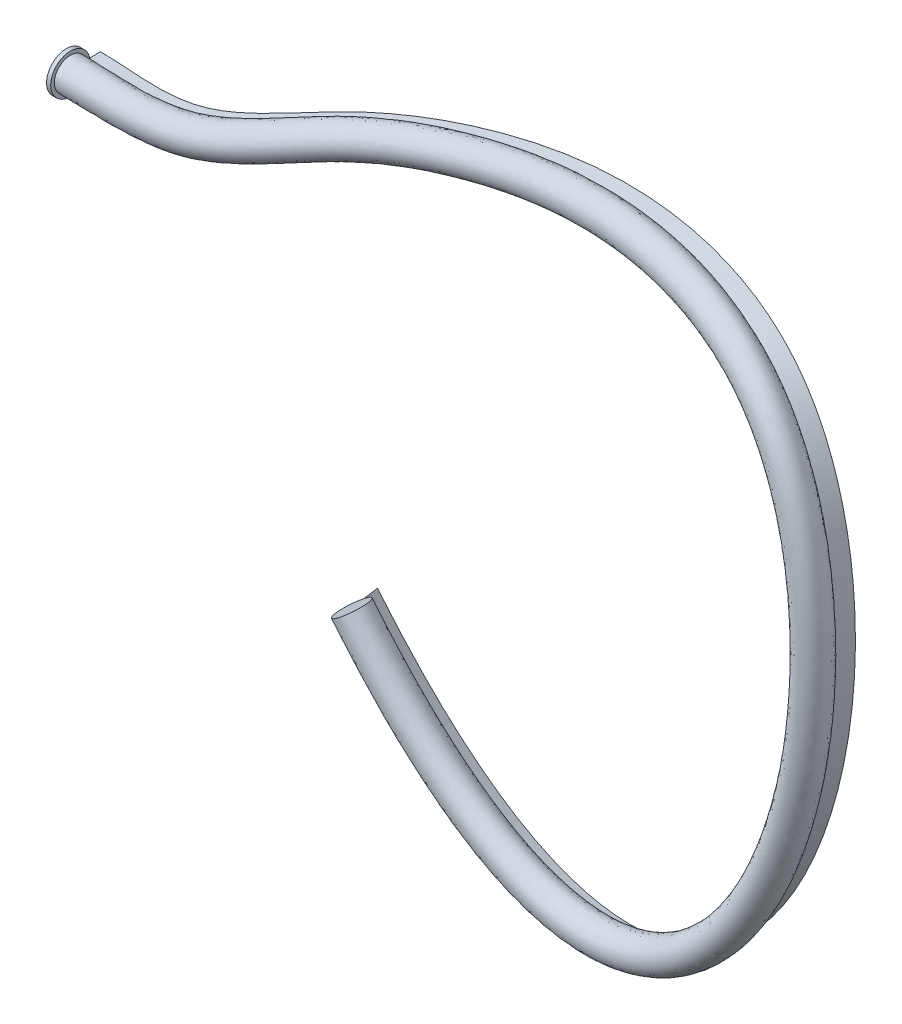
ISO-10303-21;
HEADER;
FILE_DESCRIPTION(('STEP AP214'),'2;1');
FILE_NAME('part.step','',(''),(''),'','','');
FILE_SCHEMA(('AUTOMOTIVE_DESIGN { 1 0 10303 214 1 1 1 1 }'));
ENDSEC;
DATA;
#1=APPLICATION_CONTEXT('core data for automotive mechanical design processes');
#2=APPLICATION_PROTOCOL_DEFINITION('international standard','automotive_design',2000,#1);
#3=PRODUCT_CONTEXT('',#1,'mechanical');
#4=PRODUCT('Part','Part','',(#3));
#5=PRODUCT_RELATED_PRODUCT_CATEGORY('part','',(#4));
#6=PRODUCT_DEFINITION_FORMATION('','',#4);
#7=PRODUCT_DEFINITION_CONTEXT('part definition',#1,'design');
#8=PRODUCT_DEFINITION('design','',#6,#7);
#9=PRODUCT_DEFINITION_SHAPE('','',#8);
#10=(LENGTH_UNIT() NAMED_UNIT(*) SI_UNIT(.MILLI.,.METRE.));
#11=(NAMED_UNIT(*) PLANE_ANGLE_UNIT() SI_UNIT($,.RADIAN.));
#12=(NAMED_UNIT(*) SI_UNIT($,.STERADIAN.) SOLID_ANGLE_UNIT());
#13=UNCERTAINTY_MEASURE_WITH_UNIT(LENGTH_MEASURE(1.E-05),#10,'distance_accuracy_value','');
#14=(GEOMETRIC_REPRESENTATION_CONTEXT(3) GLOBAL_UNCERTAINTY_ASSIGNED_CONTEXT((#13)) GLOBAL_UNIT_ASSIGNED_CONTEXT((#10,
#11,#12)) REPRESENTATION_CONTEXT('',''));
#15=CARTESIAN_POINT('',(0.,0.,0.));
#16=DIRECTION('',(0.,0.,1.));
#17=DIRECTION('',(1.,0.,0.));
#18=AXIS2_PLACEMENT_3D('',#15,#16,#17);
#19=CARTESIAN_POINT('',(0.,0.,0.));
#20=CARTESIAN_POINT('',(27.4642254197637,0.,0.));
#21=CARTESIAN_POINT('',(87.8028374452082,-8.95382087645974,-0.763146101907971));
#22=CARTESIAN_POINT('',(141.076947686574,2.97237020859592,-59.7113201060918));
#23=CARTESIAN_POINT('',(219.006101079918,19.7132858915344,-75.5523583560553));
#24=CARTESIAN_POINT('',(291.223654158455,30.9058604483519,-77.5395152107079));
#25=CARTESIAN_POINT('',(344.593372414246,33.3375584774099,-72.224261736461));
#26=CARTESIAN_POINT('',(383.873309377211,29.5075604955502,-66.2356873423279));
#27=CARTESIAN_POINT('',(411.068676163393,23.2112452597902,-61.3112827107355));
#28=CARTESIAN_POINT('',(435.36073516366,12.9604326469236,-56.459620523459));
#29=CARTESIAN_POINT('',(456.563884556257,-2.15390799178407,-52.0949665502684));
#30=CARTESIAN_POINT('',(473.824504640785,-22.9034678459883,-48.7196242824229));
#31=CARTESIAN_POINT('',(487.053762900805,-48.717354384585,-46.2637357664456));
#32=CARTESIAN_POINT('',(496.047324943182,-78.3126146809638,-44.70790712439));
#33=CARTESIAN_POINT('',(500.989726817628,-110.812929678873,-43.9447184981664));
#34=CARTESIAN_POINT('',(502.297493320532,-153.026500929402,-43.8547260839556));
#35=CARTESIAN_POINT('',(496.732252577597,-205.165925265141,-44.8756810767276));
#36=CARTESIAN_POINT('',(480.887884778751,-264.550287447351,-47.1983119661923));
#37=CARTESIAN_POINT('',(456.453812766938,-319.135107881967,-50.184053040146));
#38=CARTESIAN_POINT('',(427.839943869651,-359.812756889257,-52.9995220224812));
#39=CARTESIAN_POINT('',(398.315448890457,-387.079953193103,-55.268741821072));
#40=CARTESIAN_POINT('',(373.304902638258,-401.720707157502,-56.7524294496686));
#41=CARTESIAN_POINT('',(349.746263729788,-409.285806670358,-57.7793674075634));
#42=CARTESIAN_POINT('',(328.478304247406,-411.820298387361,-58.4313215676932));
#43=CARTESIAN_POINT('',(306.207940957278,-410.050720311049,-58.8126658998736));
#44=CARTESIAN_POINT('',(283.010979007269,-403.627673723908,-58.8813700954736));
#45=CARTESIAN_POINT('',(258.95063986662,-392.183859556376,-58.594278895844));
#46=CARTESIAN_POINT('',(234.137111181567,-375.418788365328,-57.9124356982976));
#47=CARTESIAN_POINT('',(208.505299568889,-352.782632553914,-56.7812142263173));
#48=CARTESIAN_POINT('',(182.644269586236,-324.656107513751,-55.2044682427444));
#49=CARTESIAN_POINT('',(164.015913233564,-300.183432395464,-53.7133567654584));
#50=CARTESIAN_POINT('',(155.564644102647,-288.161459197369,-52.9578350171391));
#51=CARTESIAN_POINT('',(0.,0.,-24.9990652689149));
#52=CARTESIAN_POINT('',(23.4397974321019,0.,-24.9990652689149));
#53=CARTESIAN_POINT('',(72.7075948441988,-8.21377026665749,-21.4570515432783));
#54=CARTESIAN_POINT('',(129.123029021942,2.93488426135868,-81.9800254527582));
#55=CARTESIAN_POINT('',(216.081974991389,21.8705259901921,-100.664995291414));
#56=CARTESIAN_POINT('',(291.99919139523,33.4885992306604,-102.394093425112));
#57=CARTESIAN_POINT('',(347.689133693887,36.000896095956,-96.9162811350075));
#58=CARTESIAN_POINT('',(388.375508660656,32.0218239063734,-90.7021882630142));
#59=CARTESIAN_POINT('',(416.452644237187,25.5140093029483,-85.6202240643835));
#60=CARTESIAN_POINT('',(441.423292363229,14.9580361215586,-80.6324669740406));
#61=CARTESIAN_POINT('',(463.012744230634,-0.453375870169354,-76.1892177364903));
#62=CARTESIAN_POINT('',(480.537454774249,-21.5211541109059,-72.7620231529115));
#63=CARTESIAN_POINT('',(493.950157659089,-47.6969986562345,-70.2721006711098));
#64=CARTESIAN_POINT('',(503.047785156256,-77.6411656536702,-68.6982503913893));
#65=CARTESIAN_POINT('',(508.041489873907,-110.480902360948,-67.9270844922746));
#66=CARTESIAN_POINT('',(509.361721054084,-153.106065149904,-67.8362184833908));
#67=CARTESIAN_POINT('',(503.746097662431,-205.750790439483,-68.8662314897073));
#68=CARTESIAN_POINT('',(487.729802068345,-265.810401146765,-71.2140861169023));
#69=CARTESIAN_POINT('',(462.935081086679,-321.238890275976,-74.2442897875836));
#70=CARTESIAN_POINT('',(433.673723597776,-362.897368003788,-77.1250238754868));
#71=CARTESIAN_POINT('',(403.090315987776,-391.178392270715,-79.4771856059041));
#72=CARTESIAN_POINT('',(376.827766744699,-406.58212931887,-81.0364814275652));
#73=CARTESIAN_POINT('',(351.824761912753,-414.620177617652,-82.1268880938059));
#74=CARTESIAN_POINT('',(329.156448486824,-417.323304958942,-82.8217817247826));
#75=CARTESIAN_POINT('',(305.465092782082,-415.435189244051,-83.2269861064821));
#76=CARTESIAN_POINT('',(280.976421399386,-408.642974092636,-83.2986036369433));
#77=CARTESIAN_POINT('',(255.840632598843,-396.674787202412,-82.9976500971865));
#78=CARTESIAN_POINT('',(230.18045054057,-379.324568083113,-82.2914665771336));
#79=CARTESIAN_POINT('',(203.903566473086,-356.110657261693,-81.1310988798192));
#80=CARTESIAN_POINT('',(177.547945048403,-327.434471618828,-79.523197570618));
#81=CARTESIAN_POINT('',(158.686828284841,-302.654762207525,-78.0133382777274));
#82=CARTESIAN_POINT('',(150.117218836602,-290.464449307895,-77.2472372090653));
#83=B_SPLINE_SURFACE_WITH_KNOTS('',1,3,((#19,#20,#21,#22,#23,#24,#25,#26,#27,#28,#29,#30,#31,
#32,#33,#34,#35,#36,#37,#38,#39,#40,#41,#42,#43,#44,#45,#46,#47,#48,#49,#50),(#51,#52,#53,#54,
#55,#56,#57,#58,#59,#60,#61,#62,#63,#64,#65,#66,#67,#68,#69,#70,#71,#72,#73,#74,#75,#76,#77,#78,
#79,#80,#81,#82)),.UNSPECIFIED.,.F.,.F.,.F.,(2,2),(4,1,1,1,1,1,1,1,1,1,1,1,1,1,1,1,1,1,1,1,1,1,
1,1,1,1,1,1,1,4),(0.,1.),(0.,0.0703125,0.140625,0.2109375,0.263671875,0.31640625,0.3427734375,
0.369140625,0.3955078125,0.421875,0.45,0.478125,0.50625,0.534375000000009,0.5625,0.609375,
0.65625,0.703125,0.75,0.78125,0.8125,0.833333333333333,0.854166666666667,0.875000000000003,
0.895833333333333,0.916666666666667,0.9375,0.958333333333333,0.979166666666667,1.),.UNSPECIFIED.);
#84=DIRECTION('',(0.,0.,-1.));
#85=VECTOR('',#84,1.);
#86=CARTESIAN_POINT('',(0.,0.,-12.4995326344575));
#87=LINE('',#86,#85);
#88=CARTESIAN_POINT('',(0.,0.,0.));
#89=VERTEX_POINT('',#88);
#90=CARTESIAN_POINT('',(0.,0.,-24.9990652689149));
#91=VERTEX_POINT('',#90);
#92=EDGE_CURVE('E13',#89,#91,#87,.T.);
#93=CARTESIAN_POINT('',(0.,0.,-24.9990652689149));
#94=CARTESIAN_POINT('',(23.4397974321019,0.,-24.9990652689149));
#95=CARTESIAN_POINT('',(72.7075948441988,-8.21377026665749,-21.4570515432783));
#96=CARTESIAN_POINT('',(129.123029021942,2.93488426135868,-81.9800254527582));
#97=CARTESIAN_POINT('',(216.081974991389,21.8705259901921,-100.664995291414));
#98=CARTESIAN_POINT('',(291.99919139523,33.4885992306604,-102.394093425112));
#99=CARTESIAN_POINT('',(347.689133693887,36.000896095956,-96.9162811350075));
#100=CARTESIAN_POINT('',(388.375508660656,32.0218239063734,-90.7021882630142));
#101=CARTESIAN_POINT('',(416.452644237187,25.5140093029483,-85.6202240643835));
#102=CARTESIAN_POINT('',(441.423292363229,14.9580361215586,-80.6324669740406));
#103=CARTESIAN_POINT('',(463.012744230634,-0.453375870169354,-76.1892177364903));
#104=CARTESIAN_POINT('',(480.537454774249,-21.5211541109059,-72.7620231529115));
#105=CARTESIAN_POINT('',(493.950157659089,-47.6969986562345,-70.2721006711098));
#106=CARTESIAN_POINT('',(503.047785156256,-77.6411656536702,-68.6982503913893));
#107=CARTESIAN_POINT('',(508.041489873907,-110.480902360948,-67.9270844922746));
#108=CARTESIAN_POINT('',(509.361721054084,-153.106065149904,-67.8362184833908));
#109=CARTESIAN_POINT('',(503.746097662431,-205.750790439483,-68.8662314897073));
#110=CARTESIAN_POINT('',(487.729802068345,-265.810401146765,-71.2140861169023));
#111=CARTESIAN_POINT('',(462.935081086679,-321.238890275976,-74.2442897875836));
#112=CARTESIAN_POINT('',(433.673723597776,-362.897368003788,-77.1250238754868));
#113=CARTESIAN_POINT('',(403.090315987776,-391.178392270715,-79.4771856059041));
#114=CARTESIAN_POINT('',(376.827766744699,-406.58212931887,-81.0364814275652));
#115=CARTESIAN_POINT('',(351.824761912753,-414.620177617652,-82.1268880938059));
#116=CARTESIAN_POINT('',(329.156448486824,-417.323304958942,-82.8217817247826));
#117=CARTESIAN_POINT('',(305.465092782082,-415.435189244051,-83.2269861064821));
#118=CARTESIAN_POINT('',(280.976421399386,-408.642974092636,-83.2986036369433));
#119=CARTESIAN_POINT('',(255.840632598843,-396.674787202412,-82.9976500971865));
#120=CARTESIAN_POINT('',(230.18045054057,-379.324568083113,-82.2914665771336));
#121=CARTESIAN_POINT('',(203.903566473086,-356.110657261693,-81.1310988798192));
#122=CARTESIAN_POINT('',(177.547945048403,-327.434471618828,-79.523197570618));
#123=CARTESIAN_POINT('',(158.686828284841,-302.654762207525,-78.0133382777274));
#124=CARTESIAN_POINT('',(150.117218836602,-290.464449307895,-77.2472372090653));
#125=B_SPLINE_CURVE_WITH_KNOTS('',3,(#93,#94,#95,#96,#97,#98,#99,#100,#101,#102,#103,#104,#105,
#106,#107,#108,#109,#110,#111,#112,#113,#114,#115,#116,#117,#118,#119,#120,#121,#122,#123,#124),
.UNSPECIFIED.,.F.,.F.,(4,1,1,1,1,1,1,1,1,1,1,1,1,1,1,1,1,1,1,1,1,1,1,1,1,1,1,1,1,4),(0.,
0.0703125,0.140625,0.2109375,0.263671875,0.31640625,0.3427734375,0.369140625,0.3955078125,
0.421875,0.45,0.478125,0.50625,0.534375000000009,0.5625,0.609375,0.65625,0.703125,0.75,0.78125,
0.8125,0.833333333333333,0.854166666666667,0.875000000000003,0.895833333333333,
0.916666666666667,0.9375,0.958333333333333,0.979166666666667,1.),.UNSPECIFIED.);
#126=CARTESIAN_POINT('',(150.117218836602,-290.464449307895,-77.2472372090653));
#127=VERTEX_POINT('',#126);
#128=EDGE_CURVE('E64',#91,#127,#125,.T.);
#129=DIRECTION('',(0.217905157950762,0.0921230488321484,0.971612415530145));
#130=VECTOR('',#129,1.);
#131=CARTESIAN_POINT('',(152.840931469625,-289.312954252632,-65.1025361131022));
#132=LINE('',#131,#130);
#133=CARTESIAN_POINT('',(155.564644102647,-288.161459197369,-52.9578350171391));
#134=VERTEX_POINT('',#133);
#135=EDGE_CURVE('E58',#127,#134,#132,.T.);
#136=CARTESIAN_POINT('',(0.,0.,0.));
#137=CARTESIAN_POINT('',(27.4642254197637,0.,0.));
#138=CARTESIAN_POINT('',(87.8028374452082,-8.95382087645974,-0.763146101907971));
#139=CARTESIAN_POINT('',(141.076947686574,2.97237020859592,-59.7113201060918));
#140=CARTESIAN_POINT('',(219.006101079918,19.7132858915344,-75.5523583560553));
#141=CARTESIAN_POINT('',(291.223654158455,30.9058604483519,-77.5395152107079));
#142=CARTESIAN_POINT('',(344.593372414246,33.3375584774099,-72.224261736461));
#143=CARTESIAN_POINT('',(383.873309377211,29.5075604955502,-66.2356873423279));
#144=CARTESIAN_POINT('',(411.068676163393,23.2112452597902,-61.3112827107355));
#145=CARTESIAN_POINT('',(435.36073516366,12.9604326469236,-56.459620523459));
#146=CARTESIAN_POINT('',(456.563884556257,-2.15390799178407,-52.0949665502684));
#147=CARTESIAN_POINT('',(473.824504640785,-22.9034678459883,-48.7196242824229));
#148=CARTESIAN_POINT('',(487.053762900805,-48.717354384585,-46.2637357664456));
#149=CARTESIAN_POINT('',(496.047324943182,-78.3126146809638,-44.70790712439));
#150=CARTESIAN_POINT('',(500.989726817628,-110.812929678873,-43.9447184981664));
#151=CARTESIAN_POINT('',(502.297493320532,-153.026500929402,-43.8547260839556));
#152=CARTESIAN_POINT('',(496.732252577597,-205.165925265141,-44.8756810767276));
#153=CARTESIAN_POINT('',(480.887884778751,-264.550287447351,-47.1983119661923));
#154=CARTESIAN_POINT('',(456.453812766938,-319.135107881967,-50.184053040146));
#155=CARTESIAN_POINT('',(427.839943869651,-359.812756889257,-52.9995220224812));
#156=CARTESIAN_POINT('',(398.315448890457,-387.079953193103,-55.268741821072));
#157=CARTESIAN_POINT('',(373.304902638258,-401.720707157502,-56.7524294496686));
#158=CARTESIAN_POINT('',(349.746263729788,-409.285806670358,-57.7793674075634));
#159=CARTESIAN_POINT('',(328.478304247406,-411.820298387361,-58.4313215676932));
#160=CARTESIAN_POINT('',(306.207940957278,-410.050720311049,-58.8126658998736));
#161=CARTESIAN_POINT('',(283.010979007269,-403.627673723908,-58.8813700954736));
#162=CARTESIAN_POINT('',(258.95063986662,-392.183859556376,-58.594278895844));
#163=CARTESIAN_POINT('',(234.137111181567,-375.418788365328,-57.9124356982976));
#164=CARTESIAN_POINT('',(208.505299568889,-352.782632553914,-56.7812142263173));
#165=CARTESIAN_POINT('',(182.644269586236,-324.656107513751,-55.2044682427444));
#166=CARTESIAN_POINT('',(164.015913233564,-300.183432395464,-53.7133567654584));
#167=CARTESIAN_POINT('',(155.564644102647,-288.161459197369,-52.9578350171391));
#168=B_SPLINE_CURVE_WITH_KNOTS('',3,(#136,#137,#138,#139,#140,#141,#142,#143,#144,#145,#146,
#147,#148,#149,#150,#151,#152,#153,#154,#155,#156,#157,#158,#159,#160,#161,#162,#163,#164,#165,
#166,#167),.UNSPECIFIED.,.F.,.F.,(4,1,1,1,1,1,1,1,1,1,1,1,1,1,1,1,1,1,1,1,1,1,1,1,1,1,1,1,1,4),
(0.,0.0703125,0.140625,0.2109375,0.263671875,0.31640625,0.3427734375,0.369140625,0.3955078125,
0.421875,0.45,0.478125,0.50625,0.534375000000009,0.5625,0.609375,0.65625,0.703125,0.75,0.78125,
0.8125,0.833333333333333,0.854166666666667,0.875000000000003,0.895833333333333,
0.916666666666667,0.9375,0.958333333333333,0.979166666666667,1.),.UNSPECIFIED.);
#169=EDGE_CURVE('E76',#134,#89,#168,.F.);
#170=ORIENTED_EDGE('',*,*,#92,.T.);
#171=ORIENTED_EDGE('',*,*,#128,.T.);
#172=ORIENTED_EDGE('',*,*,#135,.T.);
#173=ORIENTED_EDGE('',*,*,#169,.T.);
#174=EDGE_LOOP('',(#170,#171,#172,#173));
#175=FACE_BOUND('',#174,.T.);
#176=ADVANCED_FACE('F55',(#175),#83,.T.);
#177=OPEN_SHELL('',(#176));
#178=SHELL_BASED_SURFACE_MODEL('B2',(#177));
#179=CARTESIAN_POINT('',(0.,0.,-11.798578456208));
#180=CARTESIAN_POINT('',(27.4668550701451,0.,-11.798578456208));
#181=CARTESIAN_POINT('',(79.6219001172186,-9.47080007694873,-10.4435869079655));
#182=CARTESIAN_POINT('',(136.04101044417,1.44116556759052,-70.3164886691963));
#183=CARTESIAN_POINT('',(217.152486802225,22.8466134746247,-87.4333587217721));
#184=CARTESIAN_POINT('',(290.613828553932,39.9285965972346,-86.0111652084522));
#185=CARTESIAN_POINT('',(345.151405721173,44.7286244799873,-76.0006917732448));
#186=CARTESIAN_POINT('',(385.875582565366,41.1435652569248,-67.3515456670415));
#187=CARTESIAN_POINT('',(414.536348246404,34.5509488987628,-60.8281695319012));
#188=CARTESIAN_POINT('',(440.694257602597,23.4561606931636,-54.679412301622));
#189=CARTESIAN_POINT('',(464.150638838461,6.56687614546022,-49.1176045984685));
#190=CARTESIAN_POINT('',(483.319153453856,-16.4065431355194,-45.6823847655654));
#191=CARTESIAN_POINT('',(497.606891460478,-44.3387426461358,-43.0802844758989));
#192=CARTESIAN_POINT('',(507.178753621483,-75.7579824042958,-41.5847422900631));
#193=CARTESIAN_POINT('',(512.387575405091,-109.792849350638,-40.955776989202));
#194=CARTESIAN_POINT('',(513.801321415688,-153.613754762104,-41.1194783888894));
#195=CARTESIAN_POINT('',(508.133261207617,-207.370840964842,-42.5338121128056));
#196=CARTESIAN_POINT('',(491.909725755139,-268.494551521798,-45.3633537833866));
#197=CARTESIAN_POINT('',(466.732106458912,-324.910082252284,-48.8301105885248));
#198=CARTESIAN_POINT('',(436.883617986802,-367.470071127857,-52.0247302684576));
#199=CARTESIAN_POINT('',(405.462383281748,-396.558747471378,-54.6025799219932));
#200=CARTESIAN_POINT('',(378.284484865002,-412.517111889157,-56.3092437602853));
#201=CARTESIAN_POINT('',(352.283606945723,-420.881291317205,-57.5082997767388));
#202=CARTESIAN_POINT('',(328.682614216397,-423.695445391895,-58.2795557878943));
#203=CARTESIAN_POINT('',(304.075030613393,-421.729222759202,-58.7424494589015));
#204=CARTESIAN_POINT('',(278.778393634616,-414.705365827794,-58.8546718635717));
#205=CARTESIAN_POINT('',(252.985496506568,-402.413738659833,-58.58170779119));
#206=CARTESIAN_POINT('',(226.830497017917,-384.726389926122,-57.8963399274735));
#207=CARTESIAN_POINT('',(200.151066131865,-361.13615800795,-56.7521398868438));
#208=CARTESIAN_POINT('',(173.623553044773,-332.302154610751,-55.1630932881449));
#209=CARTESIAN_POINT('',(154.365511008736,-306.97113422313,-53.6559600317075));
#210=CARTESIAN_POINT('',(145.914239592717,-294.949157774466,-52.9004380791059));
#211=CARTESIAN_POINT('',(0.,23.597156912416,-11.798578456208));
#212=CARTESIAN_POINT('',(33.1720851012631,23.597156912416,-11.798578456208));
#213=CARTESIAN_POINT('',(80.4708657531915,14.1702346111108,-13.5609716019678));
#214=CARTESIAN_POINT('',(129.779418215835,24.4016256905972,-69.8374702094997));
#215=CARTESIAN_POINT('',(214.386932835871,46.2574196017225,-81.0314253396925));
#216=CARTESIAN_POINT('',(288.516495784648,56.7392743793193,-67.9085032164792));
#217=CARTESIAN_POINT('',(342.754750412326,52.303433514328,-53.4361823652539));
#218=CARTESIAN_POINT('',(382.536387867358,43.9349948188378,-44.0997434385228));
#219=CARTESIAN_POINT('',(410.294815164372,34.838901599831,-37.5808869629626));
#220=CARTESIAN_POINT('',(435.432955289132,22.1892391475377,-31.6906277970875));
#221=CARTESIAN_POINT('',(457.653808906321,4.44094784580484,-26.5251212498005));
#222=CARTESIAN_POINT('',(476.905810367845,-17.7017247320953,-23.008029937544));
#223=CARTESIAN_POINT('',(491.139870887459,-45.2834926071401,-20.4054923898474));
#224=CARTESIAN_POINT('',(500.904705734224,-76.2941265800295,-18.8416645484615));
#225=CARTESIAN_POINT('',(506.413345812973,-110.03061802396,-18.1272403738335));
#226=CARTESIAN_POINT('',(508.331274997933,-153.570223956856,-18.1617088769302));
#227=CARTESIAN_POINT('',(503.412159773961,-207.142902627496,-19.4084388319384));
#228=CARTESIAN_POINT('',(488.113651732749,-268.219239527387,-22.069287337539));
#229=CARTESIAN_POINT('',(463.763048208626,-324.662579328344,-25.4177466298911));
#230=CARTESIAN_POINT('',(434.528496132132,-367.217745405835,-28.5445499832236));
#231=CARTESIAN_POINT('',(403.631290701341,-396.249436888371,-31.0770252261061));
#232=CARTESIAN_POINT('',(376.896977272592,-412.155041950617,-32.754241960507));
#233=CARTESIAN_POINT('',(351.331736524565,-420.513808114246,-33.9321542301937));
#234=CARTESIAN_POINT('',(328.120384423066,-423.378148388662,-34.6901414262577));
#235=CARTESIAN_POINT('',(303.884439429492,-421.527991230113,-35.1458671402635));
#236=CARTESIAN_POINT('',(278.909044865836,-414.678912960941,-35.2571681701514));
#237=CARTESIAN_POINT('',(253.359026799576,-402.582115122682,-34.9871892791351));
#238=CARTESIAN_POINT('',(227.406033145272,-385.134948459022,-34.310010210698));
#239=CARTESIAN_POINT('',(200.761733356678,-361.62869063258,-33.1657903243095));
#240=CARTESIAN_POINT('',(174.627610666625,-333.407823794818,-31.61192487679));
#241=CARTESIAN_POINT('',(154.605556799959,-307.112730212577,-30.0409705120506));
#242=CARTESIAN_POINT('',(146.705050900043,-295.874220503696,-29.3346855816282));
#243=CARTESIAN_POINT('',(0.,23.597156912416,11.798578456208));
#244=CARTESIAN_POINT('',(33.1720851012631,23.597156912416,11.798578456208));
#245=CARTESIAN_POINT('',(96.8302976099116,15.2041930120888,5.79991001014723));
#246=CARTESIAN_POINT('',(139.851953546904,27.464034972608,-48.6271330832905));
#247=CARTESIAN_POINT('',(218.094032591468,39.9907644355419,-57.2694246082589));
#248=CARTESIAN_POINT('',(289.736177896704,38.693802081554,-50.9652032209906));
#249=CARTESIAN_POINT('',(341.638679963534,29.5213015091733,-45.8833222916864));
#250=CARTESIAN_POINT('',(378.531842213331,20.6629852960885,-41.8680267890955));
#251=CARTESIAN_POINT('',(403.359470804844,12.1594943218859,-38.5471133206311));
#252=CARTESIAN_POINT('',(424.765910462997,1.19778305505785,-35.2510442407614));
#253=CARTESIAN_POINT('',(442.480300327015,-13.0006204286834,-32.4798451534002));
#254=CARTESIAN_POINT('',(457.916512745802,-30.6955741530326,-29.0825089712591));
#255=CARTESIAN_POINT('',(470.033613767014,-54.040716084038,-26.7723949709409));
#256=CARTESIAN_POINT('',(478.641848377915,-81.4033911333649,-25.0879942171153));
#257=CARTESIAN_POINT('',(483.617648637968,-112.070778680429,-24.1051233917624));
#258=CARTESIAN_POINT('',(485.323618807659,-152.395716291452,-23.6322042670627));
#259=CARTESIAN_POINT('',(480.610142513909,-202.733071228094,-24.0921767597822));
#260=CARTESIAN_POINT('',(466.069969779975,-260.330711378489,-25.7392037031501));
#261=CARTESIAN_POINT('',(443.206460824681,-313.112630587715,-28.1256315331336));
#262=CARTESIAN_POINT('',(416.441147897821,-351.90311692862,-30.4941334912698));
#263=CARTESIAN_POINT('',(389.337421918786,-377.291848331859,-32.4093490242658));
#264=CARTESIAN_POINT('',(366.937812819017,-390.562232487183,-33.6406133392657));
#265=CARTESIAN_POINT('',(346.257050092903,-397.322838820846,-34.4742894918612));
#266=CARTESIAN_POINT('',(327.711764484299,-399.627854378479,-34.9936729857852));
#267=CARTESIAN_POINT('',(308.15026012019,-398.170986337973,-35.2863000224694));
#268=CARTESIAN_POINT('',(287.374215600208,-392.523528737616,-35.3105646329776));
#269=CARTESIAN_POINT('',(265.289313560484,-382.122356973813,-35.0123314920906));
#270=CARTESIAN_POINT('',(242.019261320289,-366.51974512081,-34.3422017387323));
#271=CARTESIAN_POINT('',(217.470200799058,-344.921640532963,-33.2239390540635));
#272=CARTESIAN_POINT('',(192.669041628514,-318.11572658363,-31.6946745963735));
#273=CARTESIAN_POINT('',(173.906365819819,-293.537333058383,-30.1557643881169));
#274=CARTESIAN_POINT('',(166.005859919903,-282.298823349502,-29.4494794576944));
#275=CARTESIAN_POINT('',(0.,0.,11.798578456208));
#276=CARTESIAN_POINT('',(30.3194700857041,0.,11.798578456208));
#277=CARTESIAN_POINT('',(94.6563714590261,-8.43684167597075,8.91729470414954));
#278=CARTESIAN_POINT('',(146.471985054095,4.50357484960132,-49.1061515429872));
#279=CARTESIAN_POINT('',(220.789726280593,16.5799583084442,-63.6713579903384));
#280=CARTESIAN_POINT('',(291.850272283183,21.8831242994693,-69.0678652129636));
#281=CARTESIAN_POINT('',(344.033255224415,21.9464924748326,-68.4478316996773));
#282=CARTESIAN_POINT('',(381.871428674239,17.8715557341755,-65.1198290176142));
#283=CARTESIAN_POINT('',(407.600898930526,11.8715416208179,-61.7943958895698));
#284=CARTESIAN_POINT('',(430.027240838964,2.4647046006829,-58.239828745296));
#285=CARTESIAN_POINT('',(448.977122179806,-10.8746921290247,-55.072328502068));
#286=CARTESIAN_POINT('',(464.329858055401,-29.4003925564701,-51.7568637992813));
#287=CARTESIAN_POINT('',(476.500633744243,-53.0959661229835,-49.4471870569892));
#288=CARTESIAN_POINT('',(484.915896424747,-80.8672469578184,-47.8310719587286));
#289=CARTESIAN_POINT('',(489.591878187585,-111.833010006409,-46.933660007087));
#290=CARTESIAN_POINT('',(490.793665247605,-152.43924710004,-46.5899737792318));
#291=CARTESIAN_POINT('',(485.331243925699,-202.961009543437,-47.2175500392667));
#292=CARTESIAN_POINT('',(469.866043860861,-260.606023453671,-49.0332701540737));
#293=CARTESIAN_POINT('',(446.175518862848,-313.360133210579,-51.5379954728462));
#294=CARTESIAN_POINT('',(418.796270431124,-352.155443615887,-53.9743138371648));
#295=CARTESIAN_POINT('',(391.1685128851,-377.601156618836,-55.9349035758587));
#296=CARTESIAN_POINT('',(368.32532565899,-390.924309890403,-57.1956156081623));
#297=CARTESIAN_POINT('',(347.208908022856,-397.690304255004,-58.0504339217248));
#298=CARTESIAN_POINT('',(328.274041528994,-399.945218597018,-58.5830915715724));
#299=CARTESIAN_POINT('',(308.340674789838,-398.371966774641,-58.8828665611866));
#300=CARTESIAN_POINT('',(287.24422317464,-392.550918758849,-58.9081272219305));
#301=CARTESIAN_POINT('',(264.913324559127,-381.950482985869,-58.6066302019357));
#302=CARTESIAN_POINT('',(241.452901220679,-366.124239533911,-57.9293517688142));
#303=CARTESIAN_POINT('',(216.825288171616,-344.380393649421,-56.8072271655819));
#304=CARTESIAN_POINT('',(191.792789589435,-317.191861489205,-55.2572684984855));
#305=CARTESIAN_POINT('',(173.390937270544,-293.004003699044,-53.7461353966842));
#306=CARTESIAN_POINT('',(165.215048612577,-281.373760620272,-53.0152319551722));
#307=CARTESIAN_POINT('',(0.,-23.597156912416,11.798578456208));
#308=CARTESIAN_POINT('',(27.4668550701451,-23.597156912416,11.798578456208));
#309=CARTESIAN_POINT('',(92.4824453081406,-32.0778763640303,12.0346793981519));
#310=CARTESIAN_POINT('',(153.092016561286,-18.4568852734054,-49.5851700026839));
#311=CARTESIAN_POINT('',(223.485419969718,-6.83084781865361,-70.073291372418));
#312=CARTESIAN_POINT('',(293.964366669663,5.07244651738449,-87.1705272049366));
#313=CARTESIAN_POINT('',(346.427830485296,14.3716834404919,-91.0123411076681));
#314=CARTESIAN_POINT('',(385.211015135148,15.0801261722624,-88.3716312461329));
#315=CARTESIAN_POINT('',(411.842327056208,11.5835889197499,-85.0416784585085));
#316=CARTESIAN_POINT('',(435.28857121493,3.73162614630796,-81.2286132498306));
#317=CARTESIAN_POINT('',(455.473944032597,-8.74876382936598,-77.6648118507358));
#318=CARTESIAN_POINT('',(470.743203365,-28.1052109599076,-74.4312186273036));
#319=CARTESIAN_POINT('',(482.967653721472,-52.1512161619292,-72.1219791430375));
#320=CARTESIAN_POINT('',(491.189944471579,-80.3311027822717,-70.5741497003419));
#321=CARTESIAN_POINT('',(495.566107737203,-111.595241332389,-69.7621966224116));
#322=CARTESIAN_POINT('',(496.26371168755,-152.482777908629,-69.5477432914009));
#323=CARTESIAN_POINT('',(490.052345337488,-203.188947858781,-70.3429233187512));
#324=CARTESIAN_POINT('',(473.662117941748,-260.881335528852,-72.3273366049974));
#325=CARTESIAN_POINT('',(449.144576901015,-313.607635833442,-74.9503594125587));
#326=CARTESIAN_POINT('',(421.151392964426,-352.407770303155,-77.4544941830597));
#327=CARTESIAN_POINT('',(392.999603851415,-377.910464905813,-79.4604581274517));
#328=CARTESIAN_POINT('',(369.712838498964,-391.286387293624,-80.7506178770589));
#329=CARTESIAN_POINT('',(348.160765952809,-398.057769689163,-81.6265783515884));
#330=CARTESIAN_POINT('',(328.83631857369,-400.262582815556,-82.1725101573596));
#331=CARTESIAN_POINT('',(308.531089459485,-398.572947211309,-82.4794330999038));
#332=CARTESIAN_POINT('',(287.114230749071,-392.578308780081,-82.5056898108835));
#333=CARTESIAN_POINT('',(264.53733555777,-381.778608997925,-82.2009289117809));
#334=CARTESIAN_POINT('',(240.886541121069,-365.728733947013,-81.5165017988962));
#335=CARTESIAN_POINT('',(216.180375544172,-343.83914676588,-80.3905152771003));
#336=CARTESIAN_POINT('',(190.916537550356,-316.26799639478,-78.8198624005975));
#337=CARTESIAN_POINT('',(172.87550872127,-292.470674339705,-77.3365064052514));
#338=CARTESIAN_POINT('',(164.42423730525,-280.448697891041,-76.5809844526499));
#339=CARTESIAN_POINT('',(0.,-23.597156912416,-11.798578456208));
#340=CARTESIAN_POINT('',(21.7616250390271,-23.597156912416,-11.798578456208));
#341=CARTESIAN_POINT('',(78.7729344812457,-33.1118347650083,-7.32620221396317));
#342=CARTESIAN_POINT('',(142.302602672506,-21.5192945554161,-70.7955071288931));
#343=CARTESIAN_POINT('',(219.918040768579,-0.564192652473047,-93.8352921038516));
#344=CARTESIAN_POINT('',(292.711161323215,23.1179188151498,-104.113827200425));
#345=CARTESIAN_POINT('',(347.54806103002,37.1538154456466,-98.5652011812357));
#346=CARTESIAN_POINT('',(389.214777263375,38.3521356950118,-90.6033478955602));
#347=CARTESIAN_POINT('',(418.777881328436,34.2629961976946,-84.0754521008399));
#348=CARTESIAN_POINT('',(445.955559916061,24.7230822387895,-77.6681968061566));
#349=CARTESIAN_POINT('',(470.647468770602,8.69280444511559,-71.7100879471365));
#350=CARTESIAN_POINT('',(489.732496539868,-15.1113615389434,-68.3567395935869));
#351=CARTESIAN_POINT('',(504.073912033497,-43.3939926851316,-65.7550765619504));
#352=CARTESIAN_POINT('',(513.452801508743,-75.2218382285621,-64.3278200316646));
#353=CARTESIAN_POINT('',(518.36180499721,-109.555080677316,-63.7843136045704));
#354=CARTESIAN_POINT('',(519.271367833443,-153.657285567352,-64.0772479008485));
#355=CARTESIAN_POINT('',(512.854362641273,-207.598779302188,-65.6591853936729));
#356=CARTESIAN_POINT('',(495.70579977753,-268.76986351621,-68.6574202292343));
#357=CARTESIAN_POINT('',(469.701164709197,-325.157585176224,-72.2424745471586));
#358=CARTESIAN_POINT('',(439.238739841471,-367.722396849878,-75.5049105536916));
#359=CARTESIAN_POINT('',(407.293475862156,-396.868058054384,-78.1281346178803));
#360=CARTESIAN_POINT('',(379.671992457413,-412.879181827697,-79.8642455600635));
#361=CARTESIAN_POINT('',(353.23547736688,-421.248774520164,-81.084445323284));
#362=CARTESIAN_POINT('',(329.244844009728,-424.012742395128,-81.8689701495309));
#363=CARTESIAN_POINT('',(304.265621797295,-421.930454288291,-82.3390317775395));
#364=CARTESIAN_POINT('',(278.647742403397,-414.731818694647,-82.452175556992));
#365=CARTESIAN_POINT('',(252.61196621356,-402.245362196984,-82.176226303245));
#366=CARTESIAN_POINT('',(226.254960890563,-384.317831393222,-81.482669644249));
#367=CARTESIAN_POINT('',(199.540398907051,-360.643625383319,-80.3384894493781));
#368=CARTESIAN_POINT('',(172.61949542292,-331.196485426684,-78.7142616994997));
#369=CARTESIAN_POINT('',(154.125465217514,-306.829538233683,-77.2709495513643));
#370=CARTESIAN_POINT('',(145.123428285391,-294.024095045235,-76.4661905765836));
#371=CARTESIAN_POINT('',(0.,0.,-11.798578456208));
#372=CARTESIAN_POINT('',(27.4668550701451,0.,-11.798578456208));
#373=CARTESIAN_POINT('',(79.6219001172186,-9.47080007694873,-10.4435869079655));
#374=CARTESIAN_POINT('',(136.04101044417,1.44116556759052,-70.3164886691963));
#375=CARTESIAN_POINT('',(217.152486802225,22.8466134746247,-87.4333587217721));
#376=CARTESIAN_POINT('',(290.613828553932,39.9285965972346,-86.0111652084522));
#377=CARTESIAN_POINT('',(345.151405721173,44.7286244799873,-76.0006917732448));
#378=CARTESIAN_POINT('',(385.875582565366,41.1435652569248,-67.3515456670415));
#379=CARTESIAN_POINT('',(414.536348246404,34.5509488987628,-60.8281695319012));
#380=CARTESIAN_POINT('',(440.694257602597,23.4561606931636,-54.679412301622));
#381=CARTESIAN_POINT('',(464.150638838461,6.56687614546022,-49.1176045984685));
#382=CARTESIAN_POINT('',(483.319153453856,-16.4065431355194,-45.6823847655654));
#383=CARTESIAN_POINT('',(497.606891460478,-44.3387426461358,-43.0802844758989));
#384=CARTESIAN_POINT('',(507.178753621483,-75.7579824042958,-41.5847422900631));
#385=CARTESIAN_POINT('',(512.387575405091,-109.792849350638,-40.955776989202));
#386=CARTESIAN_POINT('',(513.801321415688,-153.613754762104,-41.1194783888894));
#387=CARTESIAN_POINT('',(508.133261207617,-207.370840964842,-42.5338121128056));
#388=CARTESIAN_POINT('',(491.909725755139,-268.494551521798,-45.3633537833866));
#389=CARTESIAN_POINT('',(466.732106458912,-324.910082252284,-48.8301105885248));
#390=CARTESIAN_POINT('',(436.883617986802,-367.470071127857,-52.0247302684576));
#391=CARTESIAN_POINT('',(405.462383281748,-396.558747471378,-54.6025799219932));
#392=CARTESIAN_POINT('',(378.284484865002,-412.517111889157,-56.3092437602853));
#393=CARTESIAN_POINT('',(352.283606945723,-420.881291317205,-57.5082997767388));
#394=CARTESIAN_POINT('',(328.682614216397,-423.695445391895,-58.2795557878943));
#395=CARTESIAN_POINT('',(304.075030613393,-421.729222759202,-58.7424494589015));
#396=CARTESIAN_POINT('',(278.778393634616,-414.705365827794,-58.8546718635717));
#397=CARTESIAN_POINT('',(252.985496506568,-402.413738659833,-58.58170779119));
#398=CARTESIAN_POINT('',(226.830497017917,-384.726389926122,-57.8963399274735));
#399=CARTESIAN_POINT('',(200.151066131865,-361.13615800795,-56.7521398868438));
#400=CARTESIAN_POINT('',(173.623553044773,-332.302154610751,-55.1630932881449));
#401=CARTESIAN_POINT('',(154.365511008736,-306.97113422313,-53.6559600317075));
#402=CARTESIAN_POINT('',(145.914239592717,-294.949157774466,-52.9004380791059));
#403=(BOUNDED_SURFACE() B_SPLINE_SURFACE(3,3,((#179,#180,#181,#182,#183,#184,#185,#186,#187,
#188,#189,#190,#191,#192,#193,#194,#195,#196,#197,#198,#199,#200,#201,#202,#203,#204,#205,#206,
#207,#208,#209,#210),(#211,#212,#213,#214,#215,#216,#217,#218,#219,#220,#221,#222,#223,#224,
#225,#226,#227,#228,#229,#230,#231,#232,#233,#234,#235,#236,#237,#238,#239,#240,#241,#242),
(#243,#244,#245,#246,#247,#248,#249,#250,#251,#252,#253,#254,#255,#256,#257,#258,#259,#260,#261,
#262,#263,#264,#265,#266,#267,#268,#269,#270,#271,#272,#273,#274),(#275,#276,#277,#278,#279,
#280,#281,#282,#283,#284,#285,#286,#287,#288,#289,#290,#291,#292,#293,#294,#295,#296,#297,#298,
#299,#300,#301,#302,#303,#304,#305,#306),(#307,#308,#309,#310,#311,#312,#313,#314,#315,#316,
#317,#318,#319,#320,#321,#322,#323,#324,#325,#326,#327,#328,#329,#330,#331,#332,#333,#334,#335,
#336,#337,#338),(#339,#340,#341,#342,#343,#344,#345,#346,#347,#348,#349,#350,#351,#352,#353,
#354,#355,#356,#357,#358,#359,#360,#361,#362,#363,#364,#365,#366,#367,#368,#369,#370),(#371,
#372,#373,#374,#375,#376,#377,#378,#379,#380,#381,#382,#383,#384,#385,#386,#387,#388,#389,#390,
#391,#392,#393,#394,#395,#396,#397,#398,#399,#400,#401,#402)),.UNSPECIFIED.,.T.,.F.,
.F.) B_SPLINE_SURFACE_WITH_KNOTS((4,3,4),(4,1,1,1,1,1,1,1,1,1,1,1,1,1,1,1,1,1,1,1,1,1,1,1,1,1,1,
1,1,4),(0.,0.5,1.),(0.,0.0703125,0.140625,0.2109375,0.263671875,0.31640625,0.3427734375,
0.369140625,0.3955078125,0.421875,0.45,0.478125,0.50625,0.534375000000009,0.5625,0.609375,
0.65625,0.703125,0.75,0.78125,0.8125,0.833333333333333,0.854166666666667,0.875000000000003,
0.895833333333333,0.916666666666667,0.9375,0.958333333333333,0.979166666666667,1.),
.UNSPECIFIED.) GEOMETRIC_REPRESENTATION_ITEM() RATIONAL_B_SPLINE_SURFACE(((1.,1.,1.,1.,1.,1.,1.,
1.,1.,1.,1.,1.,1.,1.,1.,1.,1.,1.,1.,0.999999999999999,1.,1.,1.,1.,1.,1.,1.,1.,1.,1.,1.,1.),
(0.333333333333333,0.333333333333333,0.333333333333333,0.333333333333333,0.333333333333333,
0.333333333333333,0.333333333333333,0.333333333333333,0.333333333333333,0.333333333333333,
0.333333333333334,0.333333333333333,0.333333333333333,0.333333333333333,0.333333333333334,
0.333333333333333,0.333333333333333,0.333333333333333,0.333333333333333,0.333333333333333,
0.333333333333333,0.333333333333333,0.333333333333333,0.333333333333333,0.333333333333333,
0.333333333333333,0.333333333333333,0.333333333333333,0.333333333333333,0.333333333333333,
0.333333333333333,0.333333333333333),(0.333333333333333,0.333333333333333,0.333333333333333,
0.333333333333333,0.333333333333333,0.333333333333333,0.333333333333333,0.333333333333333,
0.333333333333333,0.333333333333333,0.333333333333334,0.333333333333333,0.333333333333333,
0.333333333333333,0.333333333333334,0.333333333333333,0.333333333333333,0.333333333333333,
0.333333333333333,0.333333333333333,0.333333333333333,0.333333333333333,0.333333333333333,
0.333333333333333,0.333333333333333,0.333333333333333,0.333333333333333,0.333333333333333,
0.333333333333333,0.333333333333333,0.333333333333333,0.333333333333333),(1.,1.,1.,1.,1.,1.,1.,
1.,1.,1.,1.,1.,1.,1.,1.,1.,1.,1.,1.,0.999999999999999,1.,1.,1.,1.,1.,1.,1.,1.,1.,1.,1.,1.),
(0.333333333333333,0.333333333333333,0.333333333333333,0.333333333333333,0.333333333333333,
0.333333333333333,0.333333333333333,0.333333333333333,0.333333333333333,0.333333333333333,
0.333333333333334,0.333333333333333,0.333333333333333,0.333333333333333,0.333333333333334,
0.333333333333333,0.333333333333333,0.333333333333333,0.333333333333333,0.333333333333333,
0.333333333333333,0.333333333333333,0.333333333333333,0.333333333333333,0.333333333333333,
0.333333333333333,0.333333333333333,0.333333333333333,0.333333333333333,0.333333333333333,
0.333333333333333,0.333333333333333),(0.333333333333333,0.333333333333333,0.333333333333333,
0.333333333333333,0.333333333333333,0.333333333333333,0.333333333333333,0.333333333333333,
0.333333333333333,0.333333333333333,0.333333333333334,0.333333333333333,0.333333333333333,
0.333333333333333,0.333333333333334,0.333333333333333,0.333333333333333,0.333333333333333,
0.333333333333333,0.333333333333333,0.333333333333333,0.333333333333333,0.333333333333333,
0.333333333333333,0.333333333333333,0.333333333333333,0.333333333333333,0.333333333333333,
0.333333333333333,0.333333333333333,0.333333333333333,0.333333333333333),(1.,1.,1.,1.,1.,1.,1.,
1.,1.,1.,1.,1.,1.,1.,1.,1.,1.,1.,1.,0.999999999999999,1.,1.,1.,1.,1.,1.,1.,1.,1.,1.,1.,1.))) REPRESENTATION_ITEM('') SURFACE());
#404=CARTESIAN_POINT('',(155.564644102647,-288.161459197369,-52.957835017139));
#405=DIRECTION('',(-0.574341651577696,0.817003912058257,0.0513446681215161));
#406=DIRECTION('',(-0.817929426476985,-0.575297999016613,0.00486473334445861));
#407=AXIS2_PLACEMENT_3D('',#404,#405,#406);
#408=CIRCLE('',#407,11.798578456208);
#409=CARTESIAN_POINT('',(145.914239592717,-294.949157774466,-52.9004380791059));
#410=VERTEX_POINT('',#409);
#411=EDGE_CURVE('E54',#410,#410,#408,.T.);
#412=CARTESIAN_POINT('',(3.00000000004426,-0.0184684850077786,-11.7964078242936));
#413=CARTESIAN_POINT('',(3.00000000004054,0.313200171350849,-11.7965060577167));
#414=CARTESIAN_POINT('',(3.00000000001087,0.644833745768219,-11.7826208655107));
#415=CARTESIAN_POINT('',(2.99999999998913,1.30586357693045,-11.7269821724508));
#416=CARTESIAN_POINT('',(2.99999999999709,1.63525922343501,-11.6852213560506));
#417=CARTESIAN_POINT('',(3.00000000000292,2.28971123117386,-11.5740552412133));
#418=CARTESIAN_POINT('',(3.00000000000078,2.61476254909733,-11.5046202845659));
#419=CARTESIAN_POINT('',(2.99999999999922,3.25785572875381,-11.3385983008672));
#420=CARTESIAN_POINT('',(2.99999999999979,3.57589761841124,-11.242011382006));
#421=CARTESIAN_POINT('',(3.00000000000021,4.20256085617235,-11.0224204160894));
#422=CARTESIAN_POINT('',(3.00000000000006,4.51118650488908,-10.8994286414359));
#423=CARTESIAN_POINT('',(2.99999999999994,5.1169798047803,-10.6278710000784));
#424=CARTESIAN_POINT('',(2.99999999999998,5.41414727460844,-10.479304728815));
#425=CARTESIAN_POINT('',(3.00000000000002,5.9948284118284,-10.157694437413));
#426=CARTESIAN_POINT('',(3.,6.27834554198615,-9.98465666943304));
#427=CARTESIAN_POINT('',(3.,6.82978707017405,-9.61530353437589));
#428=CARTESIAN_POINT('',(3.,7.09771153399853,-9.41898826553031));
#429=CARTESIAN_POINT('',(3.,7.61598917798112,-9.00453065318569));
#430=CARTESIAN_POINT('',(3.,7.86634715739869,-8.78639431113958));
#431=CARTESIAN_POINT('',(3.,8.34778963618231,-8.32979876707769));
#432=CARTESIAN_POINT('',(3.,8.57887411994669,-8.0913395486111));
#433=CARTESIAN_POINT('',(3.,9.02013103501024,-7.59578392430067));
#434=CARTESIAN_POINT('',(3.,9.23030269409392,-7.33868683085033));
#435=CARTESIAN_POINT('',(3.,9.62822619349897,-6.80769148113882));
#436=CARTESIAN_POINT('',(3.,9.81597804498852,-6.53379323324703));
#437=CARTESIAN_POINT('',(3.,10.1676364550216,-5.97128328596558));
#438=CARTESIAN_POINT('',(3.,10.3315547619831,-5.6826789311474));
#439=CARTESIAN_POINT('',(3.,10.6344890201946,-5.09268405007154));
#440=CARTESIAN_POINT('',(3.,10.7735049787949,-4.79129352758792));
#441=CARTESIAN_POINT('',(3.,11.025643776393,-4.17787074275176));
#442=CARTESIAN_POINT('',(3.,11.1387667079243,-3.86583851843386));
#443=CARTESIAN_POINT('',(3.,11.338314223284,-3.23335083019017));
#444=CARTESIAN_POINT('',(3.,11.4247388109456,-2.91289536747372));
#445=CARTESIAN_POINT('',(3.,11.5702515612382,-2.26594114199243));
#446=CARTESIAN_POINT('',(3.,11.6293481688526,-1.93944427864135));
#447=CARTESIAN_POINT('',(3.,11.7198238887074,-1.28263251895533));
#448=CARTESIAN_POINT('',(3.,11.7512030074864,-0.952317623521093));
#449=CARTESIAN_POINT('',(3.,11.7860207230182,-0.290219385724672));
#450=CARTESIAN_POINT('',(3.,11.789459390456,0.0415639529204496));
#451=CARTESIAN_POINT('',(3.,11.7683724711332,0.704240777937046));
#452=CARTESIAN_POINT('',(3.,11.7438468840123,1.03513426429706));
#453=CARTESIAN_POINT('',(3.,11.6670098108248,1.69365247271945));
#454=CARTESIAN_POINT('',(3.,11.6147005392429,2.02127745317651));
#455=CARTESIAN_POINT('',(3.,11.4826705548227,2.67095670287547));
#456=CARTESIAN_POINT('',(3.,11.4029498445915,2.99301097264719));
#457=CARTESIAN_POINT('',(3.,11.2166650325745,3.62926053369475));
#458=CARTESIAN_POINT('',(3.,11.1101008971301,3.94345581511573));
#459=CARTESIAN_POINT('',(3.,10.8708883836631,4.56175467105524));
#460=CARTESIAN_POINT('',(3.,10.7382400018433,4.86585824410465));
#461=CARTESIAN_POINT('',(3.,10.4477828317411,5.46185601715751));
#462=CARTESIAN_POINT('',(3.,10.2899704662021,5.75374847379686));
#463=CARTESIAN_POINT('',(3.,9.95032242813557,6.32320478509629));
#464=CARTESIAN_POINT('',(3.,9.76848675440891,6.60076863904117));
#465=CARTESIAN_POINT('',(3.,9.38208612060157,7.1395969951262));
#466=CARTESIAN_POINT('',(3.,9.17752115039136,7.40086149000231));
#467=CARTESIAN_POINT('',(3.,8.74711728719216,7.90523653522578));
#468=CARTESIAN_POINT('',(3.,8.52127838938576,8.14834708146221));
#469=CARTESIAN_POINT('',(3.,8.0498608490568,8.61476029928083));
#470=CARTESIAN_POINT('',(3.,7.80427621300353,8.83805691303852));
#471=CARTESIAN_POINT('',(3.,7.29517393463415,9.26317426890803));
#472=CARTESIAN_POINT('',(3.,7.03165628928279,9.46499500738493));
#473=CARTESIAN_POINT('',(3.,6.48856123885068,9.84572914348156));
#474=CARTESIAN_POINT('',(3.,6.2089838041818,10.0246424988954));
#475=CARTESIAN_POINT('',(3.,5.63575683615474,10.3582926283408));
#476=CARTESIAN_POINT('',(3.,5.34210729933002,10.5130293964167));
#477=CARTESIAN_POINT('',(3.,4.74271277296451,10.7972814702961));
#478=CARTESIAN_POINT('',(3.,4.43696338866956,10.9267875090593));
#479=CARTESIAN_POINT('',(3.,3.81564380931823,11.1595889507164));
#480=CARTESIAN_POINT('',(3.,3.50007361221822,11.262884348156));
#481=CARTESIAN_POINT('',(3.,2.86135481637368,11.4425322125492));
#482=CARTESIAN_POINT('',(3.,2.53820620926146,11.5188846497521));
#483=CARTESIAN_POINT('',(3.,1.88662702295623,11.6441051533797));
#484=CARTESIAN_POINT('',(3.,1.55819644241642,11.6929732127962));
#485=CARTESIAN_POINT('',(3.,0.898288884455162,11.762889020632));
#486=CARTESIAN_POINT('',(3.,0.566811033577206,11.7839285250868));
#487=CARTESIAN_POINT('',(3.,-0.0967388410166626,11.798010506906));
#488=CARTESIAN_POINT('',(3.,-0.428810864739444,11.7910529839468));
#489=CARTESIAN_POINT('',(3.,-1.09118862974099,11.7491890670813));
#490=CARTESIAN_POINT('',(3.,-1.4214943702244,11.7142826605907));
#491=CARTESIAN_POINT('',(3.,-2.07799156771625,11.616770481369));
#492=CARTESIAN_POINT('',(3.,-2.40418302401673,11.5541647038717));
#493=CARTESIAN_POINT('',(3.,-3.05015585732513,11.4016935827201));
#494=CARTESIAN_POINT('',(3.,-3.36993678045217,11.3118263161043));
#495=CARTESIAN_POINT('',(3.,-4.00079141717379,11.1054725077165));
#496=CARTESIAN_POINT('',(3.,-4.31186513063499,10.9889859655368));
#497=CARTESIAN_POINT('',(3.,-4.92309383053721,10.7302209822644));
#498=CARTESIAN_POINT('',(3.,-5.22324880798333,10.587942519925));
#499=CARTESIAN_POINT('',(3.,-5.81050517999615,10.2786042391808));
#500=CARTESIAN_POINT('',(3.,-6.09760657491204,10.1115444214389));
#501=CARTESIAN_POINT('',(3.,-6.65670884462582,9.75383276011108));
#502=CARTESIAN_POINT('',(3.,-6.92870996790182,9.56318130489721));
#503=CARTESIAN_POINT('',(3.,-7.4556812158571,9.15963814168932));
#504=CARTESIAN_POINT('',(3.,-7.71065134000969,8.94674643300749));
#505=CARTESIAN_POINT('',(3.,-8.20174521927236,8.50023500783911));
#506=CARTESIAN_POINT('',(3.,-8.43786898244705,8.26661530022244));
#507=CARTESIAN_POINT('',(3.,-8.88958821608156,7.78030760411253));
#508=CARTESIAN_POINT('',(3.,-9.10518369129074,7.52761962003089));
#509=CARTESIAN_POINT('',(3.,-9.5142546959366,7.0050413684651));
#510=CARTESIAN_POINT('',(3.,-9.70773614501223,6.73515573484043));
#511=CARTESIAN_POINT('',(3.,-10.071266491063,6.1800390365909));
#512=CARTESIAN_POINT('',(3.,-10.241315390977,5.89480797389058));
#513=CARTESIAN_POINT('',(3.,-10.5567668969135,5.31102890705981));
#514=CARTESIAN_POINT('',(3.,-10.7021695721195,5.01248094031373));
#515=CARTESIAN_POINT('',(3.,-10.9672908268756,4.40419064390618));
#516=CARTESIAN_POINT('',(3.,-11.0870094155743,4.09444831823216));
#517=CARTESIAN_POINT('',(3.,-11.2998547827043,3.46612670249578));
#518=CARTESIAN_POINT('',(3.,-11.3929945135449,3.14755180005622));
#519=CARTESIAN_POINT('',(3.,-11.552094225668,2.50368582327806));
#520=CARTESIAN_POINT('',(3.,-11.6180542151547,2.17839475096679));
#521=CARTESIAN_POINT('',(3.,-11.7223221818454,1.52341083126572));
#522=CARTESIAN_POINT('',(3.,-11.7606301793227,1.19371798710331));
#523=CARTESIAN_POINT('',(3.,-11.8093192545903,0.53227657469486));
#524=CARTESIAN_POINT('',(3.,-11.8197003404492,0.200528007042783));
#525=CARTESIAN_POINT('',(3.,-11.812461873589,-0.462501955652377));
#526=CARTESIAN_POINT('',(3.,-11.7948559415359,-0.793783499460127));
#527=CARTESIAN_POINT('',(3.,-11.7317933557831,-1.45368500832657));
#528=CARTESIAN_POINT('',(3.,-11.6863367119793,-1.78230497433093));
#529=CARTESIAN_POINT('',(3.,-11.5678960650368,-2.43454632593426));
#530=CARTESIAN_POINT('',(3.,-11.4949120496512,-2.7581677093093));
#531=CARTESIAN_POINT('',(3.,-11.3219367087152,-3.3981104127504));
#532=CARTESIAN_POINT('',(3.,-11.2219453840776,-3.71443173306317));
#533=CARTESIAN_POINT('',(3.,-10.9956862368775,-4.33747620490162));
#534=CARTESIAN_POINT('',(3.,-10.8694225676888,-4.64420086474918));
#535=CARTESIAN_POINT('',(3.,-10.5915092048093,-5.24592527396618));
#536=CARTESIAN_POINT('',(3.,-10.4398595111322,-5.54092502334189));
#537=CARTESIAN_POINT('',(3.,-10.1122612266539,-6.11709390297555));
#538=CARTESIAN_POINT('',(3.,-9.93631356689067,-6.39826356260874));
#539=CARTESIAN_POINT('',(3.,-9.56136853906447,-6.9447891299979));
#540=CARTESIAN_POINT('',(3.,-9.3623711868307,-7.21014504861362));
#541=CARTESIAN_POINT('',(3.,-8.94270056689059,-7.72321441955476));
#542=CARTESIAN_POINT('',(3.,-8.72202286930706,-7.97092424839836));
#543=CARTESIAN_POINT('',(3.,-8.26059575611887,-8.4468867434239));
#544=CARTESIAN_POINT('',(3.,-8.01984625960111,-8.67513933116264));
#545=CARTESIAN_POINT('',(3.,-7.51992449998413,-9.11062565623873));
#546=CARTESIAN_POINT('',(3.,-7.26074751459221,-9.31785397256339));
#547=CARTESIAN_POINT('',(3.,-6.72587335878776,-9.70975432228276));
#548=CARTESIAN_POINT('',(3.00000000000001,-6.45017644070736,-9.89442670007517));
#549=CARTESIAN_POINT('',(2.99999999999999,-5.88389338550812,-10.2401100262161));
#550=CARTESIAN_POINT('',(2.99999999999995,-5.59329056913892,-10.4010936527188));
#551=CARTESIAN_POINT('',(3.00000000000005,-4.99955579721713,-10.6980061384071));
#552=CARTESIAN_POINT('',(3.00000000000018,-4.69642378779389,-10.8339348898526));
#553=CARTESIAN_POINT('',(2.99999999999982,-4.0801117538617,-11.0796426810019));
#554=CARTESIAN_POINT('',(2.99999999999933,-3.7669428382543,-11.1894495705813));
#555=CARTESIAN_POINT('',(3.00000000000067,-3.1325806479124,-11.3822968307936));
#556=CARTESIAN_POINT('',(3.0000000000025,-2.81138949835737,-11.465344210958));
#557=CARTESIAN_POINT('',(2.99999999999688,-2.08192872770364,-11.6215089212415));
#558=CARTESIAN_POINT('',(2.99999999998699,-1.6719899335603,-11.6869350995764));
#559=CARTESIAN_POINT('',(3.00000000001301,-0.847505326651443,-11.7743231847755));
#560=CARTESIAN_POINT('',(3.0000000000489,-0.432959510595118,-11.796285060591));
#561=CARTESIAN_POINT('',(3.00000000004426,-0.0184684850077786,-11.7964078242936));
#562=B_SPLINE_CURVE_WITH_KNOTS('',3,(#412,#413,#414,#415,#416,#417,#418,#419,#420,#421,#422,
#423,#424,#425,#426,#427,#428,#429,#430,#431,#432,#433,#434,#435,#436,#437,#438,#439,#440,#441,
#442,#443,#444,#445,#446,#447,#448,#449,#450,#451,#452,#453,#454,#455,#456,#457,#458,#459,#460,
#461,#462,#463,#464,#465,#466,#467,#468,#469,#470,#471,#472,#473,#474,#475,#476,#477,#478,#479,
#480,#481,#482,#483,#484,#485,#486,#487,#488,#489,#490,#491,#492,#493,#494,#495,#496,#497,#498,
#499,#500,#501,#502,#503,#504,#505,#506,#507,#508,#509,#510,#511,#512,#513,#514,#515,#516,#517,
#518,#519,#520,#521,#522,#523,#524,#525,#526,#527,#528,#529,#530,#531,#532,#533,#534,#535,#536,
#537,#538,#539,#540,#541,#542,#543,#544,#545,#546,#547,#548,#549,#550,#551,#552,#553,#554,#555,
#556,#557,#558,#559,#560,#561),.UNSPECIFIED.,.T.,.F.,(4,2,2,2,2,2,2,2,2,2,2,2,2,2,2,2,2,2,2,2,2,
2,2,2,2,2,2,2,2,2,2,2,2,2,2,2,2,2,2,2,2,2,2,2,2,2,2,2,2,2,2,2,2,2,2,2,2,2,2,2,2,2,2,2,2,2,2,2,2,
2,2,2,2,2,4),(0.,0.994644196702053,1.98954952577526,2.98552396833861,3.98149444238415,
4.97700300933417,5.97252732554036,6.96779775579316,7.96306398612904,8.95805723692168,
9.95305129314165,10.9480820763428,11.9431123638788,12.9376504898536,13.9321883222755,
14.9267226004806,15.9212567358998,16.9154833313524,17.9097096922664,18.9039335379404,
19.8981573964247,20.8923020226816,21.8864465543873,22.8805923326495,23.8747382556351,
24.8690256304204,25.863313054835,26.857600922365,27.8518890150495,28.8464800570626,
29.8410712674155,30.8356643102358,31.8302575980668,32.8252155060063,33.8201736209892,
34.8151328346053,35.8100923019218,36.8053464512629,37.8006006121099,38.7958552210807,
39.791110001305,40.7864350007969,41.7817600155343,42.7770858502057,43.772411658251,
44.767721083145,45.7630305388197,46.7583395685854,47.753648368079,48.7486901091645,
49.7437317254568,50.7387705485573,51.7338090172266,52.7283617524227,53.7229141874111,
54.7174658932324,55.7120173117091,56.7060848520546,57.7001520391874,58.694219668577,
59.6882872643685,60.6821978280545,61.6761083912094,62.6699808807326,63.6638526877269,
64.65792799347,65.6520073067062,66.6463422907939,67.640662090876,68.6361198668951,
69.6315819234407,70.6259778612903,71.6201131095086,72.8631331862514,74.106154150945),.UNSPECIFIED.);
#563=CARTESIAN_POINT('',(3.00000000004426,-0.0184684850077786,-11.7964078242936));
#564=VERTEX_POINT('',#563);
#565=EDGE_CURVE('E120',#564,#564,#562,.T.);
#566=ORIENTED_EDGE('',*,*,#411,.F.);
#567=EDGE_LOOP('',(#566));
#568=FACE_BOUND('',#567,.T.);
#569=ORIENTED_EDGE('',*,*,#565,.T.);
#570=EDGE_LOOP('',(#569));
#571=FACE_BOUND('',#570,.T.);
#572=ADVANCED_FACE('F116',(#568,#571),#403,.T.);
#573=CARTESIAN_POINT('',(155.564644102647,-288.161459197369,-52.957835017139));
#574=DIRECTION('',(-0.574341651577696,0.817003912058257,0.0513446681215161));
#575=DIRECTION('',(-0.817929426476985,-0.575297999016613,0.00486473334445861));
#576=AXIS2_PLACEMENT_3D('',#573,#574,#575);
#577=PLANE('',#576);
#578=ORIENTED_EDGE('',*,*,#411,.T.);
#579=EDGE_LOOP('',(#578));
#580=FACE_BOUND('',#579,.T.);
#581=ADVANCED_FACE('F118',(#580),#577,.T.);
#582=CARTESIAN_POINT('',(3.,0.,0.));
#583=DIRECTION('',(-1.,0.,0.));
#584=DIRECTION('',(0.,0.,1.));
#585=AXIS2_PLACEMENT_3D('',#582,#583,#584);
#586=CYLINDRICAL_SURFACE('',#585,14.42737141235);
#587=CARTESIAN_POINT('',(3.,0.,0.));
#588=DIRECTION('',(-1.,0.,0.));
#589=DIRECTION('',(0.,0.,1.));
#590=AXIS2_PLACEMENT_3D('',#587,#588,#589);
#591=CIRCLE('',#590,14.42737141235);
#592=CARTESIAN_POINT('',(3.,0.,14.42737141235));
#593=VERTEX_POINT('',#592);
#594=EDGE_CURVE('E130',#593,#593,#591,.T.);
#595=ORIENTED_EDGE('',*,*,#594,.T.);
#596=EDGE_LOOP('',(#595));
#597=FACE_BOUND('',#596,.T.);
#598=CARTESIAN_POINT('',(0.,0.,0.));
#599=DIRECTION('',(-1.,0.,0.));
#600=DIRECTION('',(0.,0.,1.));
#601=AXIS2_PLACEMENT_3D('',#598,#599,#600);
#602=CIRCLE('',#601,14.42737141235);
#603=CARTESIAN_POINT('',(0.,0.,14.42737141235));
#604=VERTEX_POINT('',#603);
#605=EDGE_CURVE('E132',#604,#604,#602,.T.);
#606=ORIENTED_EDGE('',*,*,#605,.F.);
#607=EDGE_LOOP('',(#606));
#608=FACE_BOUND('',#607,.T.);
#609=ADVANCED_FACE('F138',(#597,#608),#586,.T.);
#610=CARTESIAN_POINT('',(3.,0.,0.));
#611=DIRECTION('',(-1.,0.,0.));
#612=DIRECTION('',(0.,0.,1.));
#613=AXIS2_PLACEMENT_3D('',#610,#611,#612);
#614=PLANE('',#613);
#615=ORIENTED_EDGE('',*,*,#565,.F.);
#616=EDGE_LOOP('',(#615));
#617=FACE_BOUND('',#616,.T.);
#618=ORIENTED_EDGE('',*,*,#594,.F.);
#619=EDGE_LOOP('',(#618));
#620=FACE_BOUND('',#619,.T.);
#621=ADVANCED_FACE('F141',(#617,#620),#614,.F.);
#622=CARTESIAN_POINT('',(0.,0.,0.));
#623=DIRECTION('',(1.,0.,0.));
#624=DIRECTION('',(0.,0.,-1.));
#625=AXIS2_PLACEMENT_3D('',#622,#623,#624);
#626=PLANE('',#625);
#627=ORIENTED_EDGE('',*,*,#605,.T.);
#628=EDGE_LOOP('',(#627));
#629=FACE_BOUND('',#628,.T.);
#630=ADVANCED_FACE('F143',(#629),#626,.F.);
#631=CLOSED_SHELL('',(#572,#581,#609,#621,#630));
#632=MANIFOLD_SOLID_BREP('B7',#631);
#633=ADVANCED_BREP_SHAPE_REPRESENTATION('',(#18,#632),#14);
#634=MANIFOLD_SURFACE_SHAPE_REPRESENTATION('',(#18,#178),#14);
#635=SHAPE_REPRESENTATION('',(#18),#14);
#636=SHAPE_DEFINITION_REPRESENTATION(#9,#635);
#637=SHAPE_REPRESENTATION_RELATIONSHIP('','',#635,#633);
#638=SHAPE_REPRESENTATION_RELATIONSHIP('','',#635,#634);
ENDSEC;
END-ISO-10303-21;
